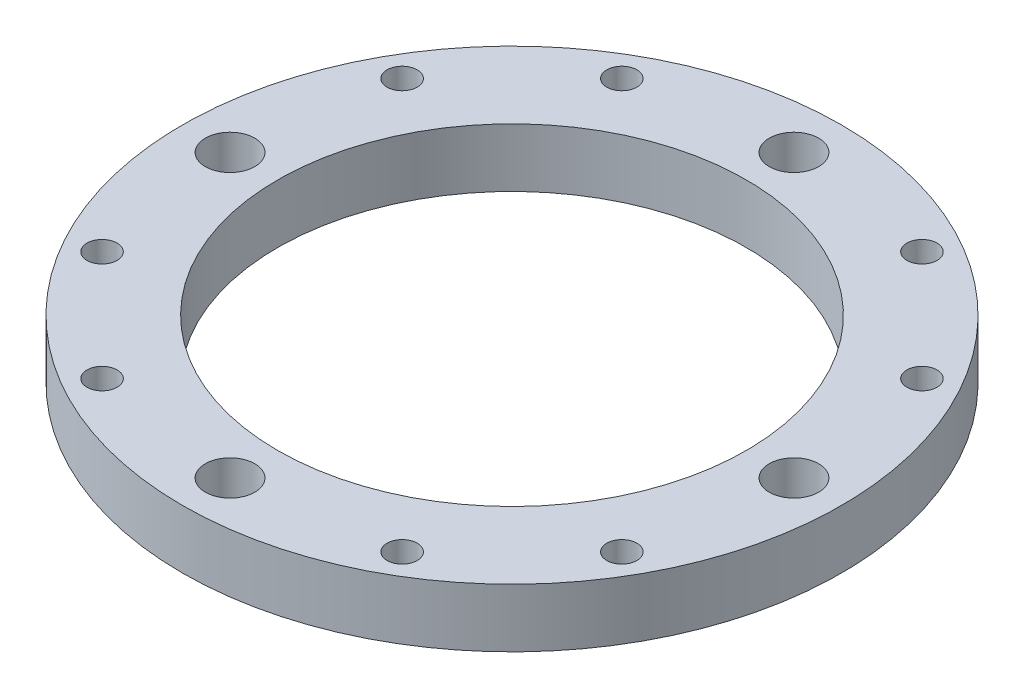
ISO-10303-21;
HEADER;
FILE_DESCRIPTION(('STEP AP214'),'2;1');
FILE_NAME('part.step','',(''),(''),'','','');
FILE_SCHEMA(('AUTOMOTIVE_DESIGN { 1 0 10303 214 1 1 1 1 }'));
ENDSEC;
DATA;
#1=APPLICATION_CONTEXT('core data for automotive mechanical design processes');
#2=APPLICATION_PROTOCOL_DEFINITION('international standard','automotive_design',2000,#1);
#3=PRODUCT_CONTEXT('',#1,'mechanical');
#4=PRODUCT('Part','Part','',(#3));
#5=PRODUCT_RELATED_PRODUCT_CATEGORY('part','',(#4));
#6=PRODUCT_DEFINITION_FORMATION('','',#4);
#7=PRODUCT_DEFINITION_CONTEXT('part definition',#1,'design');
#8=PRODUCT_DEFINITION('design','',#6,#7);
#9=PRODUCT_DEFINITION_SHAPE('','',#8);
#10=(LENGTH_UNIT() NAMED_UNIT(*) SI_UNIT(.MILLI.,.METRE.));
#11=(NAMED_UNIT(*) PLANE_ANGLE_UNIT() SI_UNIT($,.RADIAN.));
#12=(NAMED_UNIT(*) SI_UNIT($,.STERADIAN.) SOLID_ANGLE_UNIT());
#13=UNCERTAINTY_MEASURE_WITH_UNIT(LENGTH_MEASURE(1.E-05),#10,'distance_accuracy_value','');
#14=(GEOMETRIC_REPRESENTATION_CONTEXT(3) GLOBAL_UNCERTAINTY_ASSIGNED_CONTEXT((#13)) GLOBAL_UNIT_ASSIGNED_CONTEXT((#10,
#11,#12)) REPRESENTATION_CONTEXT('',''));
#15=CARTESIAN_POINT('',(0.,0.,0.));
#16=DIRECTION('',(0.,0.,1.));
#17=DIRECTION('',(1.,0.,0.));
#18=AXIS2_PLACEMENT_3D('',#15,#16,#17);
#19=CARTESIAN_POINT('',(0.,12.7,0.));
#20=DIRECTION('',(0.,1.,0.));
#21=DIRECTION('',(0.,0.,1.));
#22=AXIS2_PLACEMENT_3D('',#19,#20,#21);
#23=PLANE('',#22);
#24=CARTESIAN_POINT('',(-56.3385023543077,12.7,-32.5270495000003));
#25=DIRECTION('',(0.,1.,0.));
#26=DIRECTION('',(0.,0.,1.));
#27=AXIS2_PLACEMENT_3D('',#24,#25,#26);
#28=CIRCLE('',#27,3.2639);
#29=CARTESIAN_POINT('',(-56.3385023543077,12.7,-29.2631495000003));
#30=VERTEX_POINT('',#29);
#31=EDGE_CURVE('E87',#30,#30,#28,.T.);
#32=ORIENTED_EDGE('',*,*,#31,.F.);
#33=EDGE_LOOP('',(#32));
#34=FACE_BOUND('',#33,.T.);
#35=CARTESIAN_POINT('',(-56.338502354308,12.7,32.5270494999997));
#36=DIRECTION('',(0.,1.,0.));
#37=DIRECTION('',(0.,0.,1.));
#38=AXIS2_PLACEMENT_3D('',#35,#36,#37);
#39=CIRCLE('',#38,3.2639);
#40=CARTESIAN_POINT('',(-56.338502354308,12.7,35.7909494999997));
#41=VERTEX_POINT('',#40);
#42=EDGE_CURVE('E93',#41,#41,#39,.T.);
#43=ORIENTED_EDGE('',*,*,#42,.F.);
#44=EDGE_LOOP('',(#43));
#45=FACE_BOUND('',#44,.T.);
#46=CARTESIAN_POINT('',(-32.5270495000003,12.7,56.3385023543077));
#47=DIRECTION('',(0.,1.,0.));
#48=DIRECTION('',(0.,0.,1.));
#49=AXIS2_PLACEMENT_3D('',#46,#47,#48);
#50=CIRCLE('',#49,3.2639);
#51=CARTESIAN_POINT('',(-32.5270495000003,12.7,59.6024023543077));
#52=VERTEX_POINT('',#51);
#53=EDGE_CURVE('E99',#52,#52,#50,.T.);
#54=ORIENTED_EDGE('',*,*,#53,.F.);
#55=EDGE_LOOP('',(#54));
#56=FACE_BOUND('',#55,.T.);
#57=CARTESIAN_POINT('',(32.5270494999997,12.7,56.338502354308));
#58=DIRECTION('',(0.,1.,0.));
#59=DIRECTION('',(0.,0.,1.));
#60=AXIS2_PLACEMENT_3D('',#57,#58,#59);
#61=CIRCLE('',#60,3.2639);
#62=CARTESIAN_POINT('',(32.5270494999997,12.7,59.602402354308));
#63=VERTEX_POINT('',#62);
#64=EDGE_CURVE('E105',#63,#63,#61,.T.);
#65=ORIENTED_EDGE('',*,*,#64,.F.);
#66=EDGE_LOOP('',(#65));
#67=FACE_BOUND('',#66,.T.);
#68=CARTESIAN_POINT('',(56.3385023543077,12.7,32.5270495000003));
#69=DIRECTION('',(0.,1.,0.));
#70=DIRECTION('',(0.,0.,1.));
#71=AXIS2_PLACEMENT_3D('',#68,#69,#70);
#72=CIRCLE('',#71,3.2639);
#73=CARTESIAN_POINT('',(56.3385023543077,12.7,35.7909495000003));
#74=VERTEX_POINT('',#73);
#75=EDGE_CURVE('E111',#74,#74,#72,.T.);
#76=ORIENTED_EDGE('',*,*,#75,.F.);
#77=EDGE_LOOP('',(#76));
#78=FACE_BOUND('',#77,.T.);
#79=CARTESIAN_POINT('',(56.338502354308,12.7,-32.5270494999997));
#80=DIRECTION('',(0.,1.,0.));
#81=DIRECTION('',(0.,0.,1.));
#82=AXIS2_PLACEMENT_3D('',#79,#80,#81);
#83=CIRCLE('',#82,3.2639000000002);
#84=CARTESIAN_POINT('',(56.338502354308,12.7,-29.2631494999995));
#85=VERTEX_POINT('',#84);
#86=EDGE_CURVE('E117',#85,#85,#83,.T.);
#87=ORIENTED_EDGE('',*,*,#86,.F.);
#88=EDGE_LOOP('',(#87));
#89=FACE_BOUND('',#88,.T.);
#90=CARTESIAN_POINT('',(32.5270495000003,12.7,-56.3385023543077));
#91=DIRECTION('',(0.,1.,0.));
#92=DIRECTION('',(0.,0.,1.));
#93=AXIS2_PLACEMENT_3D('',#90,#91,#92);
#94=CIRCLE('',#93,3.26390000000016);
#95=CARTESIAN_POINT('',(32.5270495000003,12.7,-53.0746023543075));
#96=VERTEX_POINT('',#95);
#97=EDGE_CURVE('E123',#96,#96,#94,.T.);
#98=ORIENTED_EDGE('',*,*,#97,.F.);
#99=EDGE_LOOP('',(#98));
#100=FACE_BOUND('',#99,.T.);
#101=CARTESIAN_POINT('',(-32.5270494999997,12.7,-56.338502354308));
#102=DIRECTION('',(0.,1.,0.));
#103=DIRECTION('',(0.,0.,1.));
#104=AXIS2_PLACEMENT_3D('',#101,#102,#103);
#105=CIRCLE('',#104,3.2639);
#106=CARTESIAN_POINT('',(-32.5270494999997,12.7,-53.074602354308));
#107=VERTEX_POINT('',#106);
#108=EDGE_CURVE('E81',#107,#107,#105,.T.);
#109=ORIENTED_EDGE('',*,*,#108,.F.);
#110=EDGE_LOOP('',(#109));
#111=FACE_BOUND('',#110,.T.);
#112=CARTESIAN_POINT('',(-61.11875,12.7,0.));
#113=DIRECTION('',(0.,1.,0.));
#114=DIRECTION('',(0.,0.,1.));
#115=AXIS2_PLACEMENT_3D('',#112,#113,#114);
#116=CIRCLE('',#115,5.35813);
#117=CARTESIAN_POINT('',(-61.11875,12.7,5.35813));
#118=VERTEX_POINT('',#117);
#119=EDGE_CURVE('E77',#118,#118,#116,.T.);
#120=ORIENTED_EDGE('',*,*,#119,.F.);
#121=EDGE_LOOP('',(#120));
#122=FACE_BOUND('',#121,.T.);
#123=CARTESIAN_POINT('',(0.,12.7,-61.11875));
#124=DIRECTION('',(0.,1.,0.));
#125=DIRECTION('',(0.,0.,1.));
#126=AXIS2_PLACEMENT_3D('',#123,#124,#125);
#127=CIRCLE('',#126,5.35813);
#128=CARTESIAN_POINT('',(0.,12.7,-55.76062));
#129=VERTEX_POINT('',#128);
#130=EDGE_CURVE('E71',#129,#129,#127,.T.);
#131=ORIENTED_EDGE('',*,*,#130,.F.);
#132=EDGE_LOOP('',(#131));
#133=FACE_BOUND('',#132,.T.);
#134=CARTESIAN_POINT('',(61.11875,12.7,0.));
#135=DIRECTION('',(0.,1.,0.));
#136=DIRECTION('',(0.,0.,1.));
#137=AXIS2_PLACEMENT_3D('',#134,#135,#136);
#138=CIRCLE('',#137,5.35813);
#139=CARTESIAN_POINT('',(61.11875,12.7,5.35812999999998));
#140=VERTEX_POINT('',#139);
#141=EDGE_CURVE('E65',#140,#140,#138,.T.);
#142=ORIENTED_EDGE('',*,*,#141,.F.);
#143=EDGE_LOOP('',(#142));
#144=FACE_BOUND('',#143,.T.);
#145=CARTESIAN_POINT('',(0.,12.7,61.11875));
#146=DIRECTION('',(0.,1.,0.));
#147=DIRECTION('',(0.,0.,1.));
#148=AXIS2_PLACEMENT_3D('',#145,#146,#147);
#149=CIRCLE('',#148,5.35813);
#150=CARTESIAN_POINT('',(0.,12.7,66.47688));
#151=VERTEX_POINT('',#150);
#152=EDGE_CURVE('E59',#151,#151,#149,.T.);
#153=ORIENTED_EDGE('',*,*,#152,.F.);
#154=EDGE_LOOP('',(#153));
#155=FACE_BOUND('',#154,.T.);
#156=CARTESIAN_POINT('',(0.,12.7,0.));
#157=DIRECTION('',(0.,1.,0.));
#158=DIRECTION('',(0.,0.,1.));
#159=AXIS2_PLACEMENT_3D('',#156,#157,#158);
#160=CIRCLE('',#159,71.4375);
#161=CARTESIAN_POINT('',(0.,12.7,71.4375));
#162=VERTEX_POINT('',#161);
#163=EDGE_CURVE('E10',#162,#162,#160,.T.);
#164=ORIENTED_EDGE('',*,*,#163,.T.);
#165=EDGE_LOOP('',(#164));
#166=FACE_BOUND('',#165,.T.);
#167=CARTESIAN_POINT('',(0.,12.7,0.));
#168=DIRECTION('',(0.,1.,0.));
#169=DIRECTION('',(0.,0.,1.));
#170=AXIS2_PLACEMENT_3D('',#167,#168,#169);
#171=CIRCLE('',#170,50.8);
#172=CARTESIAN_POINT('',(0.,12.7,50.8));
#173=VERTEX_POINT('',#172);
#174=EDGE_CURVE('E49',#173,#173,#171,.T.);
#175=ORIENTED_EDGE('',*,*,#174,.F.);
#176=EDGE_LOOP('',(#175));
#177=FACE_BOUND('',#176,.T.);
#178=ADVANCED_FACE('F38',(#34,#45,#56,#67,#78,#89,#100,#111,#122,#133,#144,#155,#166,#177),#23,.T.);
#179=CARTESIAN_POINT('',(0.,0.,0.));
#180=DIRECTION('',(0.,1.,0.));
#181=DIRECTION('',(0.,0.,1.));
#182=AXIS2_PLACEMENT_3D('',#179,#180,#181);
#183=PLANE('',#182);
#184=CARTESIAN_POINT('',(-56.3385023543077,0.,-32.5270495000003));
#185=DIRECTION('',(0.,1.,0.));
#186=DIRECTION('',(0.,0.,1.));
#187=AXIS2_PLACEMENT_3D('',#184,#185,#186);
#188=CIRCLE('',#187,3.2639);
#189=CARTESIAN_POINT('',(-56.3385023543077,0.,-29.2631495000003));
#190=VERTEX_POINT('',#189);
#191=EDGE_CURVE('E90',#190,#190,#188,.T.);
#192=ORIENTED_EDGE('',*,*,#191,.T.);
#193=EDGE_LOOP('',(#192));
#194=FACE_BOUND('',#193,.T.);
#195=CARTESIAN_POINT('',(-56.338502354308,0.,32.5270494999997));
#196=DIRECTION('',(0.,1.,0.));
#197=DIRECTION('',(0.,0.,1.));
#198=AXIS2_PLACEMENT_3D('',#195,#196,#197);
#199=CIRCLE('',#198,3.2639);
#200=CARTESIAN_POINT('',(-56.338502354308,0.,35.7909494999997));
#201=VERTEX_POINT('',#200);
#202=EDGE_CURVE('E96',#201,#201,#199,.T.);
#203=ORIENTED_EDGE('',*,*,#202,.T.);
#204=EDGE_LOOP('',(#203));
#205=FACE_BOUND('',#204,.T.);
#206=CARTESIAN_POINT('',(-32.5270495000003,0.,56.3385023543077));
#207=DIRECTION('',(0.,1.,0.));
#208=DIRECTION('',(0.,0.,1.));
#209=AXIS2_PLACEMENT_3D('',#206,#207,#208);
#210=CIRCLE('',#209,3.2639);
#211=CARTESIAN_POINT('',(-32.5270495000003,0.,59.6024023543077));
#212=VERTEX_POINT('',#211);
#213=EDGE_CURVE('E102',#212,#212,#210,.T.);
#214=ORIENTED_EDGE('',*,*,#213,.T.);
#215=EDGE_LOOP('',(#214));
#216=FACE_BOUND('',#215,.T.);
#217=CARTESIAN_POINT('',(32.5270494999997,0.,56.338502354308));
#218=DIRECTION('',(0.,1.,0.));
#219=DIRECTION('',(0.,0.,1.));
#220=AXIS2_PLACEMENT_3D('',#217,#218,#219);
#221=CIRCLE('',#220,3.2639);
#222=CARTESIAN_POINT('',(32.5270494999997,0.,59.602402354308));
#223=VERTEX_POINT('',#222);
#224=EDGE_CURVE('E108',#223,#223,#221,.T.);
#225=ORIENTED_EDGE('',*,*,#224,.T.);
#226=EDGE_LOOP('',(#225));
#227=FACE_BOUND('',#226,.T.);
#228=CARTESIAN_POINT('',(56.3385023543077,0.,32.5270495000003));
#229=DIRECTION('',(0.,1.,0.));
#230=DIRECTION('',(0.,0.,1.));
#231=AXIS2_PLACEMENT_3D('',#228,#229,#230);
#232=CIRCLE('',#231,3.2639);
#233=CARTESIAN_POINT('',(56.3385023543077,0.,35.7909495000003));
#234=VERTEX_POINT('',#233);
#235=EDGE_CURVE('E114',#234,#234,#232,.T.);
#236=ORIENTED_EDGE('',*,*,#235,.T.);
#237=EDGE_LOOP('',(#236));
#238=FACE_BOUND('',#237,.T.);
#239=CARTESIAN_POINT('',(56.338502354308,0.,-32.5270494999997));
#240=DIRECTION('',(0.,1.,0.));
#241=DIRECTION('',(0.,0.,1.));
#242=AXIS2_PLACEMENT_3D('',#239,#240,#241);
#243=CIRCLE('',#242,3.2639000000002);
#244=CARTESIAN_POINT('',(56.338502354308,0.,-29.2631494999995));
#245=VERTEX_POINT('',#244);
#246=EDGE_CURVE('E120',#245,#245,#243,.T.);
#247=ORIENTED_EDGE('',*,*,#246,.T.);
#248=EDGE_LOOP('',(#247));
#249=FACE_BOUND('',#248,.T.);
#250=CARTESIAN_POINT('',(32.5270495000003,0.,-56.3385023543077));
#251=DIRECTION('',(0.,1.,0.));
#252=DIRECTION('',(0.,0.,1.));
#253=AXIS2_PLACEMENT_3D('',#250,#251,#252);
#254=CIRCLE('',#253,3.26390000000016);
#255=CARTESIAN_POINT('',(32.5270495000003,0.,-53.0746023543075));
#256=VERTEX_POINT('',#255);
#257=EDGE_CURVE('E84',#256,#256,#254,.T.);
#258=ORIENTED_EDGE('',*,*,#257,.T.);
#259=EDGE_LOOP('',(#258));
#260=FACE_BOUND('',#259,.T.);
#261=CARTESIAN_POINT('',(-32.5270494999997,0.,-56.338502354308));
#262=DIRECTION('',(0.,1.,0.));
#263=DIRECTION('',(0.,0.,1.));
#264=AXIS2_PLACEMENT_3D('',#261,#262,#263);
#265=CIRCLE('',#264,3.2639);
#266=CARTESIAN_POINT('',(-32.5270494999997,0.,-53.074602354308));
#267=VERTEX_POINT('',#266);
#268=EDGE_CURVE('E80',#267,#267,#265,.T.);
#269=ORIENTED_EDGE('',*,*,#268,.T.);
#270=EDGE_LOOP('',(#269));
#271=FACE_BOUND('',#270,.T.);
#272=CARTESIAN_POINT('',(-61.11875,0.,0.));
#273=DIRECTION('',(0.,1.,0.));
#274=DIRECTION('',(0.,0.,1.));
#275=AXIS2_PLACEMENT_3D('',#272,#273,#274);
#276=CIRCLE('',#275,5.35813);
#277=CARTESIAN_POINT('',(-61.11875,0.,5.35813));
#278=VERTEX_POINT('',#277);
#279=EDGE_CURVE('E74',#278,#278,#276,.T.);
#280=ORIENTED_EDGE('',*,*,#279,.T.);
#281=EDGE_LOOP('',(#280));
#282=FACE_BOUND('',#281,.T.);
#283=CARTESIAN_POINT('',(0.,0.,-61.11875));
#284=DIRECTION('',(0.,1.,0.));
#285=DIRECTION('',(0.,0.,1.));
#286=AXIS2_PLACEMENT_3D('',#283,#284,#285);
#287=CIRCLE('',#286,5.35812999999999);
#288=CARTESIAN_POINT('',(0.,0.,-55.76062));
#289=VERTEX_POINT('',#288);
#290=EDGE_CURVE('E68',#289,#289,#287,.T.);
#291=ORIENTED_EDGE('',*,*,#290,.T.);
#292=EDGE_LOOP('',(#291));
#293=FACE_BOUND('',#292,.T.);
#294=CARTESIAN_POINT('',(61.11875,0.,0.));
#295=DIRECTION('',(0.,1.,0.));
#296=DIRECTION('',(0.,0.,1.));
#297=AXIS2_PLACEMENT_3D('',#294,#295,#296);
#298=CIRCLE('',#297,5.35813);
#299=CARTESIAN_POINT('',(61.11875,0.,5.35812999999998));
#300=VERTEX_POINT('',#299);
#301=EDGE_CURVE('E62',#300,#300,#298,.T.);
#302=ORIENTED_EDGE('',*,*,#301,.T.);
#303=EDGE_LOOP('',(#302));
#304=FACE_BOUND('',#303,.T.);
#305=CARTESIAN_POINT('',(0.,0.,61.11875));
#306=DIRECTION('',(0.,1.,0.));
#307=DIRECTION('',(0.,0.,1.));
#308=AXIS2_PLACEMENT_3D('',#305,#306,#307);
#309=CIRCLE('',#308,5.35812999999999);
#310=CARTESIAN_POINT('',(0.,0.,66.47688));
#311=VERTEX_POINT('',#310);
#312=EDGE_CURVE('E54',#311,#311,#309,.T.);
#313=ORIENTED_EDGE('',*,*,#312,.T.);
#314=EDGE_LOOP('',(#313));
#315=FACE_BOUND('',#314,.T.);
#316=CARTESIAN_POINT('',(0.,0.,0.));
#317=DIRECTION('',(0.,1.,0.));
#318=DIRECTION('',(0.,0.,1.));
#319=AXIS2_PLACEMENT_3D('',#316,#317,#318);
#320=CIRCLE('',#319,71.4375);
#321=CARTESIAN_POINT('',(0.,0.,71.4375));
#322=VERTEX_POINT('',#321);
#323=EDGE_CURVE('E42',#322,#322,#320,.T.);
#324=ORIENTED_EDGE('',*,*,#323,.F.);
#325=EDGE_LOOP('',(#324));
#326=FACE_BOUND('',#325,.T.);
#327=CARTESIAN_POINT('',(0.,0.,0.));
#328=DIRECTION('',(0.,1.,0.));
#329=DIRECTION('',(0.,0.,1.));
#330=AXIS2_PLACEMENT_3D('',#327,#328,#329);
#331=CIRCLE('',#330,50.8);
#332=CARTESIAN_POINT('',(0.,0.,50.8));
#333=VERTEX_POINT('',#332);
#334=EDGE_CURVE('E51',#333,#333,#331,.T.);
#335=ORIENTED_EDGE('',*,*,#334,.T.);
#336=EDGE_LOOP('',(#335));
#337=FACE_BOUND('',#336,.T.);
#338=ADVANCED_FACE('F129',(#194,#205,#216,#227,#238,#249,#260,#271,#282,#293,#304,#315,#326,
#337),#183,.F.);
#339=CARTESIAN_POINT('',(0.,12.7,0.));
#340=DIRECTION('',(0.,-1.,0.));
#341=DIRECTION('',(0.,0.,-1.));
#342=AXIS2_PLACEMENT_3D('',#339,#340,#341);
#343=CYLINDRICAL_SURFACE('',#342,71.4375);
#344=ORIENTED_EDGE('',*,*,#163,.F.);
#345=EDGE_LOOP('',(#344));
#346=FACE_BOUND('',#345,.T.);
#347=ORIENTED_EDGE('',*,*,#323,.T.);
#348=EDGE_LOOP('',(#347));
#349=FACE_BOUND('',#348,.T.);
#350=ADVANCED_FACE('F40',(#346,#349),#343,.T.);
#351=CARTESIAN_POINT('',(0.,12.7,0.));
#352=DIRECTION('',(0.,-1.,0.));
#353=DIRECTION('',(0.,0.,-1.));
#354=AXIS2_PLACEMENT_3D('',#351,#352,#353);
#355=CYLINDRICAL_SURFACE('',#354,50.8);
#356=ORIENTED_EDGE('',*,*,#174,.T.);
#357=EDGE_LOOP('',(#356));
#358=FACE_BOUND('',#357,.T.);
#359=ORIENTED_EDGE('',*,*,#334,.F.);
#360=EDGE_LOOP('',(#359));
#361=FACE_BOUND('',#360,.T.);
#362=ADVANCED_FACE('F156',(#358,#361),#355,.F.);
#363=CARTESIAN_POINT('',(0.,12.7,61.11875));
#364=DIRECTION('',(0.,1.,0.));
#365=DIRECTION('',(0.,0.,1.));
#366=AXIS2_PLACEMENT_3D('',#363,#364,#365);
#367=CYLINDRICAL_SURFACE('',#366,5.35813);
#368=ORIENTED_EDGE('',*,*,#312,.F.);
#369=EDGE_LOOP('',(#368));
#370=FACE_BOUND('',#369,.T.);
#371=ORIENTED_EDGE('',*,*,#152,.T.);
#372=EDGE_LOOP('',(#371));
#373=FACE_BOUND('',#372,.T.);
#374=ADVANCED_FACE('F159',(#370,#373),#367,.F.);
#375=CARTESIAN_POINT('',(61.11875,12.7,0.));
#376=DIRECTION('',(0.,1.,0.));
#377=DIRECTION('',(0.,0.,1.));
#378=AXIS2_PLACEMENT_3D('',#375,#376,#377);
#379=CYLINDRICAL_SURFACE('',#378,5.35813);
#380=ORIENTED_EDGE('',*,*,#301,.F.);
#381=EDGE_LOOP('',(#380));
#382=FACE_BOUND('',#381,.T.);
#383=ORIENTED_EDGE('',*,*,#141,.T.);
#384=EDGE_LOOP('',(#383));
#385=FACE_BOUND('',#384,.T.);
#386=ADVANCED_FACE('F174',(#382,#385),#379,.F.);
#387=CARTESIAN_POINT('',(0.,12.7,-61.11875));
#388=DIRECTION('',(0.,1.,0.));
#389=DIRECTION('',(0.,0.,1.));
#390=AXIS2_PLACEMENT_3D('',#387,#388,#389);
#391=CYLINDRICAL_SURFACE('',#390,5.35813);
#392=ORIENTED_EDGE('',*,*,#290,.F.);
#393=EDGE_LOOP('',(#392));
#394=FACE_BOUND('',#393,.T.);
#395=ORIENTED_EDGE('',*,*,#130,.T.);
#396=EDGE_LOOP('',(#395));
#397=FACE_BOUND('',#396,.T.);
#398=ADVANCED_FACE('F178',(#394,#397),#391,.F.);
#399=CARTESIAN_POINT('',(-61.11875,12.7,0.));
#400=DIRECTION('',(0.,1.,0.));
#401=DIRECTION('',(0.,0.,1.));
#402=AXIS2_PLACEMENT_3D('',#399,#400,#401);
#403=CYLINDRICAL_SURFACE('',#402,5.35813);
#404=ORIENTED_EDGE('',*,*,#279,.F.);
#405=EDGE_LOOP('',(#404));
#406=FACE_BOUND('',#405,.T.);
#407=ORIENTED_EDGE('',*,*,#119,.T.);
#408=EDGE_LOOP('',(#407));
#409=FACE_BOUND('',#408,.T.);
#410=ADVANCED_FACE('F182',(#406,#409),#403,.F.);
#411=CARTESIAN_POINT('',(-32.5270494999997,0.,-56.338502354308));
#412=DIRECTION('',(0.,1.,0.));
#413=DIRECTION('',(0.,0.,1.));
#414=AXIS2_PLACEMENT_3D('',#411,#412,#413);
#415=CYLINDRICAL_SURFACE('',#414,3.2639);
#416=ORIENTED_EDGE('',*,*,#268,.F.);
#417=EDGE_LOOP('',(#416));
#418=FACE_BOUND('',#417,.T.);
#419=ORIENTED_EDGE('',*,*,#108,.T.);
#420=EDGE_LOOP('',(#419));
#421=FACE_BOUND('',#420,.T.);
#422=ADVANCED_FACE('F136',(#418,#421),#415,.F.);
#423=CARTESIAN_POINT('',(32.5270495000003,0.,-56.3385023543077));
#424=DIRECTION('',(0.,1.,0.));
#425=DIRECTION('',(0.,0.,1.));
#426=AXIS2_PLACEMENT_3D('',#423,#424,#425);
#427=CYLINDRICAL_SURFACE('',#426,3.26390000000016);
#428=ORIENTED_EDGE('',*,*,#257,.F.);
#429=EDGE_LOOP('',(#428));
#430=FACE_BOUND('',#429,.T.);
#431=ORIENTED_EDGE('',*,*,#97,.T.);
#432=EDGE_LOOP('',(#431));
#433=FACE_BOUND('',#432,.T.);
#434=ADVANCED_FACE('F132',(#430,#433),#427,.F.);
#435=CARTESIAN_POINT('',(56.338502354308,0.,-32.5270494999997));
#436=DIRECTION('',(0.,1.,0.));
#437=DIRECTION('',(0.,0.,1.));
#438=AXIS2_PLACEMENT_3D('',#435,#436,#437);
#439=CYLINDRICAL_SURFACE('',#438,3.2639000000002);
#440=ORIENTED_EDGE('',*,*,#246,.F.);
#441=EDGE_LOOP('',(#440));
#442=FACE_BOUND('',#441,.T.);
#443=ORIENTED_EDGE('',*,*,#86,.T.);
#444=EDGE_LOOP('',(#443));
#445=FACE_BOUND('',#444,.T.);
#446=ADVANCED_FACE('F135',(#442,#445),#439,.F.);
#447=CARTESIAN_POINT('',(56.3385023543077,0.,32.5270495000003));
#448=DIRECTION('',(0.,1.,0.));
#449=DIRECTION('',(0.,0.,1.));
#450=AXIS2_PLACEMENT_3D('',#447,#448,#449);
#451=CYLINDRICAL_SURFACE('',#450,3.2639);
#452=ORIENTED_EDGE('',*,*,#235,.F.);
#453=EDGE_LOOP('',(#452));
#454=FACE_BOUND('',#453,.T.);
#455=ORIENTED_EDGE('',*,*,#75,.T.);
#456=EDGE_LOOP('',(#455));
#457=FACE_BOUND('',#456,.T.);
#458=ADVANCED_FACE('F205',(#454,#457),#451,.F.);
#459=CARTESIAN_POINT('',(32.5270494999997,0.,56.338502354308));
#460=DIRECTION('',(0.,1.,0.));
#461=DIRECTION('',(0.,0.,1.));
#462=AXIS2_PLACEMENT_3D('',#459,#460,#461);
#463=CYLINDRICAL_SURFACE('',#462,3.2639);
#464=ORIENTED_EDGE('',*,*,#224,.F.);
#465=EDGE_LOOP('',(#464));
#466=FACE_BOUND('',#465,.T.);
#467=ORIENTED_EDGE('',*,*,#64,.T.);
#468=EDGE_LOOP('',(#467));
#469=FACE_BOUND('',#468,.T.);
#470=ADVANCED_FACE('F201',(#466,#469),#463,.F.);
#471=CARTESIAN_POINT('',(-32.5270495000003,0.,56.3385023543077));
#472=DIRECTION('',(0.,1.,0.));
#473=DIRECTION('',(0.,0.,1.));
#474=AXIS2_PLACEMENT_3D('',#471,#472,#473);
#475=CYLINDRICAL_SURFACE('',#474,3.2639);
#476=ORIENTED_EDGE('',*,*,#213,.F.);
#477=EDGE_LOOP('',(#476));
#478=FACE_BOUND('',#477,.T.);
#479=ORIENTED_EDGE('',*,*,#53,.T.);
#480=EDGE_LOOP('',(#479));
#481=FACE_BOUND('',#480,.T.);
#482=ADVANCED_FACE('F197',(#478,#481),#475,.F.);
#483=CARTESIAN_POINT('',(-56.338502354308,0.,32.5270494999997));
#484=DIRECTION('',(0.,1.,0.));
#485=DIRECTION('',(0.,0.,1.));
#486=AXIS2_PLACEMENT_3D('',#483,#484,#485);
#487=CYLINDRICAL_SURFACE('',#486,3.2639);
#488=ORIENTED_EDGE('',*,*,#202,.F.);
#489=EDGE_LOOP('',(#488));
#490=FACE_BOUND('',#489,.T.);
#491=ORIENTED_EDGE('',*,*,#42,.T.);
#492=EDGE_LOOP('',(#491));
#493=FACE_BOUND('',#492,.T.);
#494=ADVANCED_FACE('F193',(#490,#493),#487,.F.);
#495=CARTESIAN_POINT('',(-56.3385023543077,0.,-32.5270495000003));
#496=DIRECTION('',(0.,1.,0.));
#497=DIRECTION('',(0.,0.,1.));
#498=AXIS2_PLACEMENT_3D('',#495,#496,#497);
#499=CYLINDRICAL_SURFACE('',#498,3.2639);
#500=ORIENTED_EDGE('',*,*,#191,.F.);
#501=EDGE_LOOP('',(#500));
#502=FACE_BOUND('',#501,.T.);
#503=ORIENTED_EDGE('',*,*,#31,.T.);
#504=EDGE_LOOP('',(#503));
#505=FACE_BOUND('',#504,.T.);
#506=ADVANCED_FACE('F190',(#502,#505),#499,.F.);
#507=CLOSED_SHELL('',(#178,#338,#350,#362,#374,#386,#398,#410,#422,#434,#446,#458,#470,#482,
#494,#506));
#508=MANIFOLD_SOLID_BREP('B2',#507);
#509=ADVANCED_BREP_SHAPE_REPRESENTATION('',(#18,#508),#14);
#510=SHAPE_DEFINITION_REPRESENTATION(#9,#509);
ENDSEC;
END-ISO-10303-21;
